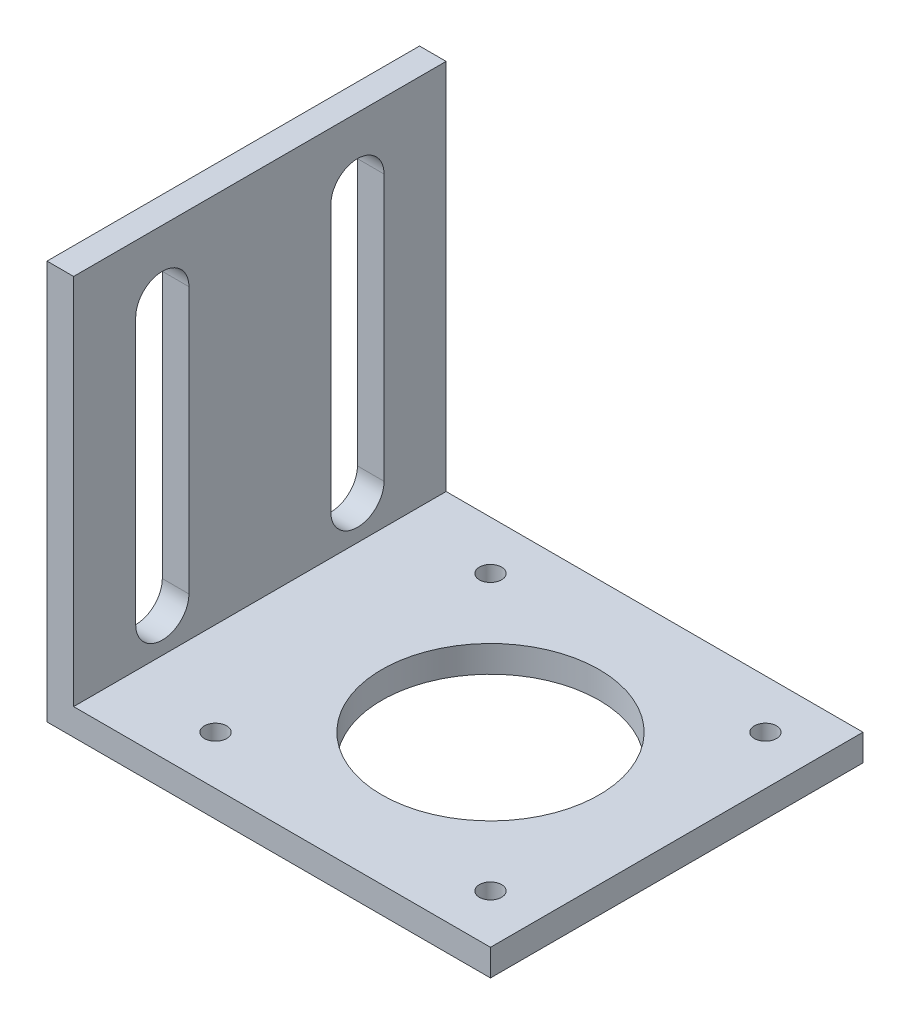
ISO-10303-21;
HEADER;
FILE_DESCRIPTION(('STEP AP214'),'2;1');
FILE_NAME('part.step','',(''),(''),'','','');
FILE_SCHEMA(('AUTOMOTIVE_DESIGN { 1 0 10303 214 1 1 1 1 }'));
ENDSEC;
DATA;
#1=APPLICATION_CONTEXT('core data for automotive mechanical design processes');
#2=APPLICATION_PROTOCOL_DEFINITION('international standard','automotive_design',2000,#1);
#3=PRODUCT_CONTEXT('',#1,'mechanical');
#4=PRODUCT('Part','Part','',(#3));
#5=PRODUCT_RELATED_PRODUCT_CATEGORY('part','',(#4));
#6=PRODUCT_DEFINITION_FORMATION('','',#4);
#7=PRODUCT_DEFINITION_CONTEXT('part definition',#1,'design');
#8=PRODUCT_DEFINITION('design','',#6,#7);
#9=PRODUCT_DEFINITION_SHAPE('','',#8);
#10=(LENGTH_UNIT() NAMED_UNIT(*) SI_UNIT(.MILLI.,.METRE.));
#11=(NAMED_UNIT(*) PLANE_ANGLE_UNIT() SI_UNIT($,.RADIAN.));
#12=(NAMED_UNIT(*) SI_UNIT($,.STERADIAN.) SOLID_ANGLE_UNIT());
#13=UNCERTAINTY_MEASURE_WITH_UNIT(LENGTH_MEASURE(1.E-05),#10,'distance_accuracy_value','');
#14=(GEOMETRIC_REPRESENTATION_CONTEXT(3) GLOBAL_UNCERTAINTY_ASSIGNED_CONTEXT((#13)) GLOBAL_UNIT_ASSIGNED_CONTEXT((#10,
#11,#12)) REPRESENTATION_CONTEXT('',''));
#15=CARTESIAN_POINT('',(0.,0.,0.));
#16=DIRECTION('',(0.,0.,1.));
#17=DIRECTION('',(1.,0.,0.));
#18=AXIS2_PLACEMENT_3D('',#15,#16,#17);
#19=CARTESIAN_POINT('',(25.,3.,-21.));
#20=DIRECTION('',(-1.,0.,0.));
#21=DIRECTION('',(0.,0.,1.));
#22=AXIS2_PLACEMENT_3D('',#19,#20,#21);
#23=PLANE('',#22);
#24=DIRECTION('',(0.,0.,-1.));
#25=VECTOR('',#24,1.);
#26=CARTESIAN_POINT('',(25.,0.,-21.));
#27=LINE('',#26,#25);
#28=CARTESIAN_POINT('',(25.,0.,21.));
#29=VERTEX_POINT('',#28);
#30=CARTESIAN_POINT('',(25.,0.,-21.));
#31=VERTEX_POINT('',#30);
#32=EDGE_CURVE('E246',#29,#31,#27,.T.);
#33=ORIENTED_EDGE('',*,*,#32,.T.);
#34=DIRECTION('',(0.,-1.,0.));
#35=VECTOR('',#34,1.);
#36=CARTESIAN_POINT('',(25.,3.,-21.));
#37=LINE('',#36,#35);
#38=CARTESIAN_POINT('',(25.,3.,-21.));
#39=VERTEX_POINT('',#38);
#40=EDGE_CURVE('E281',#39,#31,#37,.T.);
#41=ORIENTED_EDGE('',*,*,#40,.F.);
#42=DIRECTION('',(0.,0.,-1.));
#43=VECTOR('',#42,1.);
#44=CARTESIAN_POINT('',(25.,3.,-21.));
#45=LINE('',#44,#43);
#46=CARTESIAN_POINT('',(25.,3.,21.));
#47=VERTEX_POINT('',#46);
#48=EDGE_CURVE('E247',#47,#39,#45,.T.);
#49=ORIENTED_EDGE('',*,*,#48,.F.);
#50=DIRECTION('',(0.,-1.,0.));
#51=VECTOR('',#50,1.);
#52=CARTESIAN_POINT('',(25.,3.,21.));
#53=LINE('',#52,#51);
#54=EDGE_CURVE('E258',#47,#29,#53,.T.);
#55=ORIENTED_EDGE('',*,*,#54,.T.);
#56=EDGE_LOOP('',(#33,#41,#49,#55));
#57=FACE_BOUND('',#56,.T.);
#58=ADVANCED_FACE('F51',(#57),#23,.F.);
#59=CARTESIAN_POINT('',(-25.,3.,-21.));
#60=DIRECTION('',(0.,0.,1.));
#61=DIRECTION('',(1.,0.,0.));
#62=AXIS2_PLACEMENT_3D('',#59,#60,#61);
#63=PLANE('',#62);
#64=DIRECTION('',(-1.,0.,0.));
#65=VECTOR('',#64,1.);
#66=CARTESIAN_POINT('',(-25.,0.,-21.));
#67=LINE('',#66,#65);
#68=CARTESIAN_POINT('',(-25.,0.,-21.));
#69=VERTEX_POINT('',#68);
#70=EDGE_CURVE('E262',#31,#69,#67,.T.);
#71=ORIENTED_EDGE('',*,*,#70,.T.);
#72=DIRECTION('',(0.,-1.,0.));
#73=VECTOR('',#72,1.);
#74=CARTESIAN_POINT('',(-25.,3.,-21.));
#75=LINE('',#74,#73);
#76=CARTESIAN_POINT('',(-25.,45.,-21.));
#77=VERTEX_POINT('',#76);
#78=EDGE_CURVE('E277',#77,#69,#75,.T.);
#79=ORIENTED_EDGE('',*,*,#78,.F.);
#80=DIRECTION('',(-1.,0.,0.));
#81=VECTOR('',#80,1.);
#82=CARTESIAN_POINT('',(-25.,45.,-21.));
#83=LINE('',#82,#81);
#84=CARTESIAN_POINT('',(-22.,45.,-21.));
#85=VERTEX_POINT('',#84);
#86=EDGE_CURVE('E231',#85,#77,#83,.T.);
#87=ORIENTED_EDGE('',*,*,#86,.F.);
#88=DIRECTION('',(0.,-1.,0.));
#89=VECTOR('',#88,1.);
#90=CARTESIAN_POINT('',(-22.,45.,-21.));
#91=LINE('',#90,#89);
#92=CARTESIAN_POINT('',(-22.,3.,-21.));
#93=VERTEX_POINT('',#92);
#94=EDGE_CURVE('E235',#85,#93,#91,.T.);
#95=ORIENTED_EDGE('',*,*,#94,.T.);
#96=DIRECTION('',(-1.,0.,0.));
#97=VECTOR('',#96,1.);
#98=CARTESIAN_POINT('',(-25.,3.,-21.));
#99=LINE('',#98,#97);
#100=EDGE_CURVE('E251',#39,#93,#99,.T.);
#101=ORIENTED_EDGE('',*,*,#100,.F.);
#102=ORIENTED_EDGE('',*,*,#40,.T.);
#103=EDGE_LOOP('',(#71,#79,#87,#95,#101,#102));
#104=FACE_BOUND('',#103,.T.);
#105=ADVANCED_FACE('F345',(#104),#63,.F.);
#106=CARTESIAN_POINT('',(-25.,3.,-21.));
#107=DIRECTION('',(1.,0.,0.));
#108=DIRECTION('',(0.,0.,-1.));
#109=AXIS2_PLACEMENT_3D('',#106,#107,#108);
#110=PLANE('',#109);
#111=DIRECTION('',(0.,1.,0.));
#112=VECTOR('',#111,1.);
#113=CARTESIAN_POINT('',(-25.,0.,-8.));
#114=LINE('',#113,#112);
#115=CARTESIAN_POINT('',(-25.,7.50000000000001,-8.));
#116=VERTEX_POINT('',#115);
#117=CARTESIAN_POINT('',(-25.,37.5,-8.00000000000001));
#118=VERTEX_POINT('',#117);
#119=EDGE_CURVE('E172',#116,#118,#114,.T.);
#120=ORIENTED_EDGE('',*,*,#119,.F.);
#121=CARTESIAN_POINT('',(-25.,7.50000000000001,-11.));
#122=DIRECTION('',(-1.,0.,0.));
#123=DIRECTION('',(0.,0.,1.));
#124=AXIS2_PLACEMENT_3D('',#121,#122,#123);
#125=CIRCLE('',#124,3.);
#126=CARTESIAN_POINT('',(-25.,7.50000000000001,-14.));
#127=VERTEX_POINT('',#126);
#128=EDGE_CURVE('E68',#127,#116,#125,.T.);
#129=ORIENTED_EDGE('',*,*,#128,.F.);
#130=DIRECTION('',(0.,1.,0.));
#131=VECTOR('',#130,1.);
#132=CARTESIAN_POINT('',(-25.,0.,-14.));
#133=LINE('',#132,#131);
#134=CARTESIAN_POINT('',(-25.,37.5,-14.));
#135=VERTEX_POINT('',#134);
#136=EDGE_CURVE('E180',#127,#135,#133,.T.);
#137=ORIENTED_EDGE('',*,*,#136,.T.);
#138=CARTESIAN_POINT('',(-25.,37.5,-11.));
#139=DIRECTION('',(-1.,0.,0.));
#140=DIRECTION('',(0.,0.,1.));
#141=AXIS2_PLACEMENT_3D('',#138,#139,#140);
#142=CIRCLE('',#141,3.);
#143=EDGE_CURVE('E161',#118,#135,#142,.T.);
#144=ORIENTED_EDGE('',*,*,#143,.F.);
#145=EDGE_LOOP('',(#120,#129,#137,#144));
#146=FACE_BOUND('',#145,.T.);
#147=CARTESIAN_POINT('',(-25.,37.5,11.));
#148=DIRECTION('',(-1.,0.,0.));
#149=DIRECTION('',(0.,0.,1.));
#150=AXIS2_PLACEMENT_3D('',#147,#148,#149);
#151=CIRCLE('',#150,3.);
#152=CARTESIAN_POINT('',(-25.,37.5,14.));
#153=VERTEX_POINT('',#152);
#154=CARTESIAN_POINT('',(-25.,37.5,7.99999999999999));
#155=VERTEX_POINT('',#154);
#156=EDGE_CURVE('E197',#153,#155,#151,.T.);
#157=ORIENTED_EDGE('',*,*,#156,.F.);
#158=DIRECTION('',(0.,1.,0.));
#159=VECTOR('',#158,1.);
#160=CARTESIAN_POINT('',(-25.,0.,14.));
#161=LINE('',#160,#159);
#162=CARTESIAN_POINT('',(-25.,7.50000000000003,14.));
#163=VERTEX_POINT('',#162);
#164=EDGE_CURVE('E76',#163,#153,#161,.T.);
#165=ORIENTED_EDGE('',*,*,#164,.F.);
#166=CARTESIAN_POINT('',(-25.,7.50000000000003,11.));
#167=DIRECTION('',(-1.,0.,0.));
#168=DIRECTION('',(0.,0.,1.));
#169=AXIS2_PLACEMENT_3D('',#166,#167,#168);
#170=CIRCLE('',#169,3.);
#171=CARTESIAN_POINT('',(-25.,7.50000000000002,8.));
#172=VERTEX_POINT('',#171);
#173=EDGE_CURVE('E205',#172,#163,#170,.T.);
#174=ORIENTED_EDGE('',*,*,#173,.F.);
#175=DIRECTION('',(0.,1.,0.));
#176=VECTOR('',#175,1.);
#177=CARTESIAN_POINT('',(-25.,0.,8.));
#178=LINE('',#177,#176);
#179=EDGE_CURVE('E201',#172,#155,#178,.T.);
#180=ORIENTED_EDGE('',*,*,#179,.T.);
#181=EDGE_LOOP('',(#157,#165,#174,#180));
#182=FACE_BOUND('',#181,.T.);
#183=DIRECTION('',(0.,0.,1.));
#184=VECTOR('',#183,1.);
#185=CARTESIAN_POINT('',(-25.,0.,-21.));
#186=LINE('',#185,#184);
#187=CARTESIAN_POINT('',(-25.,0.,21.));
#188=VERTEX_POINT('',#187);
#189=EDGE_CURVE('E265',#69,#188,#186,.T.);
#190=ORIENTED_EDGE('',*,*,#189,.T.);
#191=DIRECTION('',(0.,-1.,0.));
#192=VECTOR('',#191,1.);
#193=CARTESIAN_POINT('',(-25.,3.,21.));
#194=LINE('',#193,#192);
#195=CARTESIAN_POINT('',(-25.,45.,21.));
#196=VERTEX_POINT('',#195);
#197=EDGE_CURVE('E273',#196,#188,#194,.T.);
#198=ORIENTED_EDGE('',*,*,#197,.F.);
#199=DIRECTION('',(0.,0.,1.));
#200=VECTOR('',#199,1.);
#201=CARTESIAN_POINT('',(-25.,45.,-21.));
#202=LINE('',#201,#200);
#203=EDGE_CURVE('E221',#77,#196,#202,.T.);
#204=ORIENTED_EDGE('',*,*,#203,.F.);
#205=ORIENTED_EDGE('',*,*,#78,.T.);
#206=EDGE_LOOP('',(#190,#198,#204,#205));
#207=FACE_BOUND('',#206,.T.);
#208=ADVANCED_FACE('F177',(#146,#182,#207),#110,.F.);
#209=CARTESIAN_POINT('',(-25.,3.,21.));
#210=DIRECTION('',(0.,0.,-1.));
#211=DIRECTION('',(-1.,0.,0.));
#212=AXIS2_PLACEMENT_3D('',#209,#210,#211);
#213=PLANE('',#212);
#214=DIRECTION('',(1.,0.,0.));
#215=VECTOR('',#214,1.);
#216=CARTESIAN_POINT('',(-25.,0.,21.));
#217=LINE('',#216,#215);
#218=EDGE_CURVE('E252',#188,#29,#217,.T.);
#219=ORIENTED_EDGE('',*,*,#218,.T.);
#220=ORIENTED_EDGE('',*,*,#54,.F.);
#221=DIRECTION('',(1.,0.,0.));
#222=VECTOR('',#221,1.);
#223=CARTESIAN_POINT('',(-25.,3.,21.));
#224=LINE('',#223,#222);
#225=CARTESIAN_POINT('',(-22.,3.,21.));
#226=VERTEX_POINT('',#225);
#227=EDGE_CURVE('E255',#226,#47,#224,.T.);
#228=ORIENTED_EDGE('',*,*,#227,.F.);
#229=DIRECTION('',(0.,-1.,0.));
#230=VECTOR('',#229,1.);
#231=CARTESIAN_POINT('',(-22.,45.,21.));
#232=LINE('',#231,#230);
#233=CARTESIAN_POINT('',(-22.,45.,21.));
#234=VERTEX_POINT('',#233);
#235=EDGE_CURVE('E242',#234,#226,#232,.T.);
#236=ORIENTED_EDGE('',*,*,#235,.F.);
#237=DIRECTION('',(1.,0.,0.));
#238=VECTOR('',#237,1.);
#239=CARTESIAN_POINT('',(-25.,45.,21.));
#240=LINE('',#239,#238);
#241=EDGE_CURVE('E225',#196,#234,#240,.T.);
#242=ORIENTED_EDGE('',*,*,#241,.F.);
#243=ORIENTED_EDGE('',*,*,#197,.T.);
#244=EDGE_LOOP('',(#219,#220,#228,#236,#242,#243));
#245=FACE_BOUND('',#244,.T.);
#246=ADVANCED_FACE('F365',(#245),#213,.F.);
#247=CARTESIAN_POINT('',(0.,3.,0.));
#248=DIRECTION('',(0.,1.,0.));
#249=DIRECTION('',(0.,0.,1.));
#250=AXIS2_PLACEMENT_3D('',#247,#248,#249);
#251=PLANE('',#250);
#252=CARTESIAN_POINT('',(-11.5,3.,-15.4999999999748));
#253=DIRECTION('',(0.,1.,0.));
#254=DIRECTION('',(0.,0.,1.));
#255=AXIS2_PLACEMENT_3D('',#252,#253,#254);
#256=CIRCLE('',#255,1.25000000000721);
#257=CARTESIAN_POINT('',(-11.5,3.,-14.2499999999675));
#258=VERTEX_POINT('',#257);
#259=EDGE_CURVE('E479',#258,#258,#256,.T.);
#260=ORIENTED_EDGE('',*,*,#259,.F.);
#261=EDGE_LOOP('',(#260));
#262=FACE_BOUND('',#261,.T.);
#263=CARTESIAN_POINT('',(19.5,3.,-15.5000000000002));
#264=DIRECTION('',(0.,1.,0.));
#265=DIRECTION('',(0.,0.,1.));
#266=AXIS2_PLACEMENT_3D('',#263,#264,#265);
#267=CIRCLE('',#266,1.25);
#268=CARTESIAN_POINT('',(19.5,3.,-14.2500000000002));
#269=VERTEX_POINT('',#268);
#270=EDGE_CURVE('E472',#269,#269,#267,.T.);
#271=ORIENTED_EDGE('',*,*,#270,.F.);
#272=EDGE_LOOP('',(#271));
#273=FACE_BOUND('',#272,.T.);
#274=CARTESIAN_POINT('',(19.5,3.,15.4999999999743));
#275=DIRECTION('',(0.,1.,0.));
#276=DIRECTION('',(0.,0.,1.));
#277=AXIS2_PLACEMENT_3D('',#274,#275,#276);
#278=CIRCLE('',#277,1.24999999999152);
#279=CARTESIAN_POINT('',(19.5,3.,16.7499999999658));
#280=VERTEX_POINT('',#279);
#281=EDGE_CURVE('E460',#280,#280,#278,.T.);
#282=ORIENTED_EDGE('',*,*,#281,.F.);
#283=EDGE_LOOP('',(#282));
#284=FACE_BOUND('',#283,.T.);
#285=CARTESIAN_POINT('',(-11.4999999999745,3.,15.4999999999998));
#286=DIRECTION('',(0.,1.,0.));
#287=DIRECTION('',(0.,0.,1.));
#288=AXIS2_PLACEMENT_3D('',#285,#286,#287);
#289=CIRCLE('',#288,1.24999999997535);
#290=CARTESIAN_POINT('',(-11.4999999999745,3.,16.7499999999751));
#291=VERTEX_POINT('',#290);
#292=EDGE_CURVE('E471',#291,#291,#289,.T.);
#293=ORIENTED_EDGE('',*,*,#292,.F.);
#294=EDGE_LOOP('',(#293));
#295=FACE_BOUND('',#294,.T.);
#296=CARTESIAN_POINT('',(4.00000000000003,3.,-2.22044604925031E-13));
#297=DIRECTION('',(0.,1.,0.));
#298=DIRECTION('',(0.,0.,1.));
#299=AXIS2_PLACEMENT_3D('',#296,#297,#298);
#300=CIRCLE('',#299,12.25);
#301=CARTESIAN_POINT('',(4.00000000000003,3.,12.2499999999998));
#302=VERTEX_POINT('',#301);
#303=EDGE_CURVE('E313',#302,#302,#300,.T.);
#304=ORIENTED_EDGE('',*,*,#303,.F.);
#305=EDGE_LOOP('',(#304));
#306=FACE_BOUND('',#305,.T.);
#307=DIRECTION('',(0.,0.,-1.));
#308=VECTOR('',#307,1.);
#309=CARTESIAN_POINT('',(-22.,3.,-21.));
#310=LINE('',#309,#308);
#311=EDGE_CURVE('E190',#226,#93,#310,.T.);
#312=ORIENTED_EDGE('',*,*,#311,.F.);
#313=ORIENTED_EDGE('',*,*,#227,.T.);
#314=ORIENTED_EDGE('',*,*,#48,.T.);
#315=ORIENTED_EDGE('',*,*,#100,.T.);
#316=EDGE_LOOP('',(#312,#313,#314,#315));
#317=FACE_BOUND('',#316,.T.);
#318=ADVANCED_FACE('F361',(#262,#273,#284,#295,#306,#317),#251,.T.);
#319=CARTESIAN_POINT('',(0.,0.,0.));
#320=DIRECTION('',(0.,1.,0.));
#321=DIRECTION('',(0.,0.,1.));
#322=AXIS2_PLACEMENT_3D('',#319,#320,#321);
#323=PLANE('',#322);
#324=CARTESIAN_POINT('',(-11.5,0.,-15.4999999999748));
#325=DIRECTION('',(0.,1.,0.));
#326=DIRECTION('',(0.,0.,1.));
#327=AXIS2_PLACEMENT_3D('',#324,#325,#326);
#328=CIRCLE('',#327,1.25000000000721);
#329=CARTESIAN_POINT('',(-11.5,0.,-14.2499999999675));
#330=VERTEX_POINT('',#329);
#331=EDGE_CURVE('E54',#330,#330,#328,.T.);
#332=ORIENTED_EDGE('',*,*,#331,.T.);
#333=EDGE_LOOP('',(#332));
#334=FACE_BOUND('',#333,.T.);
#335=CARTESIAN_POINT('',(19.5,0.,-15.5000000000002));
#336=DIRECTION('',(0.,1.,0.));
#337=DIRECTION('',(0.,0.,1.));
#338=AXIS2_PLACEMENT_3D('',#335,#336,#337);
#339=CIRCLE('',#338,1.25);
#340=CARTESIAN_POINT('',(19.5,0.,-14.2500000000002));
#341=VERTEX_POINT('',#340);
#342=EDGE_CURVE('E320',#341,#341,#339,.T.);
#343=ORIENTED_EDGE('',*,*,#342,.T.);
#344=EDGE_LOOP('',(#343));
#345=FACE_BOUND('',#344,.T.);
#346=CARTESIAN_POINT('',(19.5,0.,15.4999999999743));
#347=DIRECTION('',(0.,1.,0.));
#348=DIRECTION('',(0.,0.,1.));
#349=AXIS2_PLACEMENT_3D('',#346,#347,#348);
#350=CIRCLE('',#349,1.24999999999152);
#351=CARTESIAN_POINT('',(19.5,0.,16.7499999999658));
#352=VERTEX_POINT('',#351);
#353=EDGE_CURVE('E317',#352,#352,#350,.T.);
#354=ORIENTED_EDGE('',*,*,#353,.T.);
#355=EDGE_LOOP('',(#354));
#356=FACE_BOUND('',#355,.T.);
#357=CARTESIAN_POINT('',(-11.4999999999745,0.,15.4999999999998));
#358=DIRECTION('',(0.,1.,0.));
#359=DIRECTION('',(0.,0.,1.));
#360=AXIS2_PLACEMENT_3D('',#357,#358,#359);
#361=CIRCLE('',#360,1.24999999997535);
#362=CARTESIAN_POINT('',(-11.4999999999745,0.,16.7499999999751));
#363=VERTEX_POINT('',#362);
#364=EDGE_CURVE('E312',#363,#363,#361,.T.);
#365=ORIENTED_EDGE('',*,*,#364,.T.);
#366=EDGE_LOOP('',(#365));
#367=FACE_BOUND('',#366,.T.);
#368=CARTESIAN_POINT('',(4.00000000000003,0.,-2.22044604925031E-13));
#369=DIRECTION('',(0.,1.,0.));
#370=DIRECTION('',(0.,0.,1.));
#371=AXIS2_PLACEMENT_3D('',#368,#369,#370);
#372=CIRCLE('',#371,12.25);
#373=CARTESIAN_POINT('',(4.00000000000003,0.,12.2499999999998));
#374=VERTEX_POINT('',#373);
#375=EDGE_CURVE('E308',#374,#374,#372,.T.);
#376=ORIENTED_EDGE('',*,*,#375,.T.);
#377=EDGE_LOOP('',(#376));
#378=FACE_BOUND('',#377,.T.);
#379=ORIENTED_EDGE('',*,*,#32,.F.);
#380=ORIENTED_EDGE('',*,*,#218,.F.);
#381=ORIENTED_EDGE('',*,*,#189,.F.);
#382=ORIENTED_EDGE('',*,*,#70,.F.);
#383=EDGE_LOOP('',(#379,#380,#381,#382));
#384=FACE_BOUND('',#383,.T.);
#385=ADVANCED_FACE('F329',(#334,#345,#356,#367,#378,#384),#323,.F.);
#386=CARTESIAN_POINT('',(-22.,45.,-21.));
#387=DIRECTION('',(-1.,0.,0.));
#388=DIRECTION('',(0.,0.,1.));
#389=AXIS2_PLACEMENT_3D('',#386,#387,#388);
#390=PLANE('',#389);
#391=DIRECTION('',(0.,1.,0.));
#392=VECTOR('',#391,1.);
#393=CARTESIAN_POINT('',(-22.,45.,-14.));
#394=LINE('',#393,#392);
#395=CARTESIAN_POINT('',(-22.,7.50000000000001,-14.));
#396=VERTEX_POINT('',#395);
#397=CARTESIAN_POINT('',(-22.,37.5,-14.));
#398=VERTEX_POINT('',#397);
#399=EDGE_CURVE('E60',#396,#398,#394,.T.);
#400=ORIENTED_EDGE('',*,*,#399,.F.);
#401=CARTESIAN_POINT('',(-22.,7.50000000000001,-11.));
#402=DIRECTION('',(-1.,0.,0.));
#403=DIRECTION('',(0.,0.,1.));
#404=AXIS2_PLACEMENT_3D('',#401,#402,#403);
#405=CIRCLE('',#404,3.);
#406=CARTESIAN_POINT('',(-22.,7.50000000000001,-8.));
#407=VERTEX_POINT('',#406);
#408=EDGE_CURVE('E13',#396,#407,#405,.T.);
#409=ORIENTED_EDGE('',*,*,#408,.T.);
#410=DIRECTION('',(0.,1.,0.));
#411=VECTOR('',#410,1.);
#412=CARTESIAN_POINT('',(-22.,45.,-8.00000000000001));
#413=LINE('',#412,#411);
#414=CARTESIAN_POINT('',(-22.,37.5,-8.00000000000001));
#415=VERTEX_POINT('',#414);
#416=EDGE_CURVE('E301',#407,#415,#413,.T.);
#417=ORIENTED_EDGE('',*,*,#416,.T.);
#418=CARTESIAN_POINT('',(-22.,37.5,-11.));
#419=DIRECTION('',(-1.,0.,0.));
#420=DIRECTION('',(0.,0.,1.));
#421=AXIS2_PLACEMENT_3D('',#418,#419,#420);
#422=CIRCLE('',#421,3.);
#423=EDGE_CURVE('E164',#415,#398,#422,.T.);
#424=ORIENTED_EDGE('',*,*,#423,.T.);
#425=EDGE_LOOP('',(#400,#409,#417,#424));
#426=FACE_BOUND('',#425,.T.);
#427=CARTESIAN_POINT('',(-22.,7.50000000000003,11.));
#428=DIRECTION('',(-1.,0.,0.));
#429=DIRECTION('',(0.,0.,1.));
#430=AXIS2_PLACEMENT_3D('',#427,#428,#429);
#431=CIRCLE('',#430,3.);
#432=CARTESIAN_POINT('',(-22.,7.50000000000002,8.));
#433=VERTEX_POINT('',#432);
#434=CARTESIAN_POINT('',(-22.,7.50000000000003,14.));
#435=VERTEX_POINT('',#434);
#436=EDGE_CURVE('E293',#433,#435,#431,.T.);
#437=ORIENTED_EDGE('',*,*,#436,.T.);
#438=DIRECTION('',(0.,1.,0.));
#439=VECTOR('',#438,1.);
#440=CARTESIAN_POINT('',(-22.,45.,14.));
#441=LINE('',#440,#439);
#442=CARTESIAN_POINT('',(-22.,37.5,14.));
#443=VERTEX_POINT('',#442);
#444=EDGE_CURVE('E297',#435,#443,#441,.T.);
#445=ORIENTED_EDGE('',*,*,#444,.T.);
#446=CARTESIAN_POINT('',(-22.,37.5,11.));
#447=DIRECTION('',(-1.,0.,0.));
#448=DIRECTION('',(0.,0.,1.));
#449=AXIS2_PLACEMENT_3D('',#446,#447,#448);
#450=CIRCLE('',#449,3.);
#451=CARTESIAN_POINT('',(-22.,37.5,8.));
#452=VERTEX_POINT('',#451);
#453=EDGE_CURVE('E285',#443,#452,#450,.T.);
#454=ORIENTED_EDGE('',*,*,#453,.T.);
#455=DIRECTION('',(0.,1.,0.));
#456=VECTOR('',#455,1.);
#457=CARTESIAN_POINT('',(-22.,45.,7.99999999999999));
#458=LINE('',#457,#456);
#459=EDGE_CURVE('E289',#433,#452,#458,.T.);
#460=ORIENTED_EDGE('',*,*,#459,.F.);
#461=EDGE_LOOP('',(#437,#445,#454,#460));
#462=FACE_BOUND('',#461,.T.);
#463=ORIENTED_EDGE('',*,*,#311,.T.);
#464=ORIENTED_EDGE('',*,*,#94,.F.);
#465=DIRECTION('',(0.,0.,-1.));
#466=VECTOR('',#465,1.);
#467=CARTESIAN_POINT('',(-22.,45.,-21.));
#468=LINE('',#467,#466);
#469=EDGE_CURVE('E228',#234,#85,#468,.T.);
#470=ORIENTED_EDGE('',*,*,#469,.F.);
#471=ORIENTED_EDGE('',*,*,#235,.T.);
#472=EDGE_LOOP('',(#463,#464,#470,#471));
#473=FACE_BOUND('',#472,.T.);
#474=ADVANCED_FACE('F373',(#426,#462,#473),#390,.F.);
#475=CARTESIAN_POINT('',(0.,45.,0.));
#476=DIRECTION('',(0.,1.,0.));
#477=DIRECTION('',(0.,0.,1.));
#478=AXIS2_PLACEMENT_3D('',#475,#476,#477);
#479=PLANE('',#478);
#480=ORIENTED_EDGE('',*,*,#203,.T.);
#481=ORIENTED_EDGE('',*,*,#241,.T.);
#482=ORIENTED_EDGE('',*,*,#469,.T.);
#483=ORIENTED_EDGE('',*,*,#86,.T.);
#484=EDGE_LOOP('',(#480,#481,#482,#483));
#485=FACE_BOUND('',#484,.T.);
#486=ADVANCED_FACE('F370',(#485),#479,.T.);
#487=CARTESIAN_POINT('',(-15.,0.,14.));
#488=DIRECTION('',(0.,0.,1.));
#489=DIRECTION('',(1.,0.,0.));
#490=AXIS2_PLACEMENT_3D('',#487,#488,#489);
#491=PLANE('',#490);
#492=DIRECTION('',(-1.,0.,0.));
#493=VECTOR('',#492,1.);
#494=CARTESIAN_POINT('',(-15.,7.50000000000003,14.));
#495=LINE('',#494,#493);
#496=EDGE_CURVE('E210',#435,#163,#495,.T.);
#497=ORIENTED_EDGE('',*,*,#496,.T.);
#498=ORIENTED_EDGE('',*,*,#164,.T.);
#499=DIRECTION('',(-1.,0.,0.));
#500=VECTOR('',#499,1.);
#501=CARTESIAN_POINT('',(-15.,37.5,14.));
#502=LINE('',#501,#500);
#503=EDGE_CURVE('E209',#443,#153,#502,.T.);
#504=ORIENTED_EDGE('',*,*,#503,.F.);
#505=ORIENTED_EDGE('',*,*,#444,.F.);
#506=EDGE_LOOP('',(#497,#498,#504,#505));
#507=FACE_BOUND('',#506,.T.);
#508=ADVANCED_FACE('F381',(#507),#491,.F.);
#509=CARTESIAN_POINT('',(-15.,7.50000000000003,11.));
#510=DIRECTION('',(-1.,0.,0.));
#511=DIRECTION('',(0.,0.,1.));
#512=AXIS2_PLACEMENT_3D('',#509,#510,#511);
#513=CYLINDRICAL_SURFACE('',#512,3.);
#514=DIRECTION('',(-1.,0.,0.));
#515=VECTOR('',#514,1.);
#516=CARTESIAN_POINT('',(-15.,7.50000000000002,8.));
#517=LINE('',#516,#515);
#518=EDGE_CURVE('E213',#433,#172,#517,.T.);
#519=ORIENTED_EDGE('',*,*,#518,.T.);
#520=ORIENTED_EDGE('',*,*,#173,.T.);
#521=ORIENTED_EDGE('',*,*,#496,.F.);
#522=ORIENTED_EDGE('',*,*,#436,.F.);
#523=EDGE_LOOP('',(#519,#520,#521,#522));
#524=FACE_BOUND('',#523,.T.);
#525=ADVANCED_FACE('F532',(#524),#513,.F.);
#526=CARTESIAN_POINT('',(-15.,0.,8.));
#527=DIRECTION('',(0.,0.,1.));
#528=DIRECTION('',(0.,-1.,0.));
#529=AXIS2_PLACEMENT_3D('',#526,#527,#528);
#530=PLANE('',#529);
#531=ORIENTED_EDGE('',*,*,#459,.T.);
#532=DIRECTION('',(-1.,0.,0.));
#533=VECTOR('',#532,1.);
#534=CARTESIAN_POINT('',(-15.,37.5,7.99999999999999));
#535=LINE('',#534,#533);
#536=EDGE_CURVE('E216',#452,#155,#535,.T.);
#537=ORIENTED_EDGE('',*,*,#536,.T.);
#538=ORIENTED_EDGE('',*,*,#179,.F.);
#539=ORIENTED_EDGE('',*,*,#518,.F.);
#540=EDGE_LOOP('',(#531,#537,#538,#539));
#541=FACE_BOUND('',#540,.T.);
#542=ADVANCED_FACE('F524',(#541),#530,.T.);
#543=CARTESIAN_POINT('',(-15.,37.5,11.));
#544=DIRECTION('',(-1.,0.,0.));
#545=DIRECTION('',(0.,0.,1.));
#546=AXIS2_PLACEMENT_3D('',#543,#544,#545);
#547=CYLINDRICAL_SURFACE('',#546,3.);
#548=ORIENTED_EDGE('',*,*,#503,.T.);
#549=ORIENTED_EDGE('',*,*,#156,.T.);
#550=ORIENTED_EDGE('',*,*,#536,.F.);
#551=ORIENTED_EDGE('',*,*,#453,.F.);
#552=EDGE_LOOP('',(#548,#549,#550,#551));
#553=FACE_BOUND('',#552,.T.);
#554=ADVANCED_FACE('F517',(#553),#547,.F.);
#555=CARTESIAN_POINT('',(-15.,7.50000000000001,-11.));
#556=DIRECTION('',(-1.,0.,0.));
#557=DIRECTION('',(0.,0.,1.));
#558=AXIS2_PLACEMENT_3D('',#555,#556,#557);
#559=CYLINDRICAL_SURFACE('',#558,3.);
#560=DIRECTION('',(-1.,0.,0.));
#561=VECTOR('',#560,1.);
#562=CARTESIAN_POINT('',(-15.,7.50000000000001,-14.));
#563=LINE('',#562,#561);
#564=EDGE_CURVE('E187',#396,#127,#563,.T.);
#565=ORIENTED_EDGE('',*,*,#564,.T.);
#566=ORIENTED_EDGE('',*,*,#128,.T.);
#567=DIRECTION('',(-1.,0.,0.));
#568=VECTOR('',#567,1.);
#569=CARTESIAN_POINT('',(-15.,7.50000000000001,-8.00000000000001));
#570=LINE('',#569,#568);
#571=EDGE_CURVE('E169',#407,#116,#570,.T.);
#572=ORIENTED_EDGE('',*,*,#571,.F.);
#573=ORIENTED_EDGE('',*,*,#408,.F.);
#574=EDGE_LOOP('',(#565,#566,#572,#573));
#575=FACE_BOUND('',#574,.T.);
#576=ADVANCED_FACE('F509',(#575),#559,.F.);
#577=CARTESIAN_POINT('',(-15.,0.,-14.));
#578=DIRECTION('',(0.,0.,1.));
#579=DIRECTION('',(1.,0.,0.));
#580=AXIS2_PLACEMENT_3D('',#577,#578,#579);
#581=PLANE('',#580);
#582=ORIENTED_EDGE('',*,*,#399,.T.);
#583=DIRECTION('',(-1.,0.,0.));
#584=VECTOR('',#583,1.);
#585=CARTESIAN_POINT('',(-15.,37.5,-14.));
#586=LINE('',#585,#584);
#587=EDGE_CURVE('E168',#398,#135,#586,.T.);
#588=ORIENTED_EDGE('',*,*,#587,.T.);
#589=ORIENTED_EDGE('',*,*,#136,.F.);
#590=ORIENTED_EDGE('',*,*,#564,.F.);
#591=EDGE_LOOP('',(#582,#588,#589,#590));
#592=FACE_BOUND('',#591,.T.);
#593=ADVANCED_FACE('F502',(#592),#581,.T.);
#594=CARTESIAN_POINT('',(-15.,37.5,-11.));
#595=DIRECTION('',(-1.,0.,0.));
#596=DIRECTION('',(0.,0.,1.));
#597=AXIS2_PLACEMENT_3D('',#594,#595,#596);
#598=CYLINDRICAL_SURFACE('',#597,3.);
#599=DIRECTION('',(-1.,0.,0.));
#600=VECTOR('',#599,1.);
#601=CARTESIAN_POINT('',(-15.,37.5,-8.00000000000001));
#602=LINE('',#601,#600);
#603=EDGE_CURVE('E156',#415,#118,#602,.T.);
#604=ORIENTED_EDGE('',*,*,#603,.T.);
#605=ORIENTED_EDGE('',*,*,#143,.T.);
#606=ORIENTED_EDGE('',*,*,#587,.F.);
#607=ORIENTED_EDGE('',*,*,#423,.F.);
#608=EDGE_LOOP('',(#604,#605,#606,#607));
#609=FACE_BOUND('',#608,.T.);
#610=ADVANCED_FACE('F158',(#609),#598,.F.);
#611=CARTESIAN_POINT('',(-15.,0.,-8.00000000000001));
#612=DIRECTION('',(0.,0.,1.));
#613=DIRECTION('',(1.,0.,0.));
#614=AXIS2_PLACEMENT_3D('',#611,#612,#613);
#615=PLANE('',#614);
#616=ORIENTED_EDGE('',*,*,#571,.T.);
#617=ORIENTED_EDGE('',*,*,#119,.T.);
#618=ORIENTED_EDGE('',*,*,#603,.F.);
#619=ORIENTED_EDGE('',*,*,#416,.F.);
#620=EDGE_LOOP('',(#616,#617,#618,#619));
#621=FACE_BOUND('',#620,.T.);
#622=ADVANCED_FACE('F173',(#621),#615,.F.);
#623=CARTESIAN_POINT('',(4.00000000000003,-7.,-2.22044604925031E-13));
#624=DIRECTION('',(0.,1.,0.));
#625=DIRECTION('',(0.,0.,1.));
#626=AXIS2_PLACEMENT_3D('',#623,#624,#625);
#627=CYLINDRICAL_SURFACE('',#626,12.25);
#628=ORIENTED_EDGE('',*,*,#303,.T.);
#629=EDGE_LOOP('',(#628));
#630=FACE_BOUND('',#629,.T.);
#631=ORIENTED_EDGE('',*,*,#375,.F.);
#632=EDGE_LOOP('',(#631));
#633=FACE_BOUND('',#632,.T.);
#634=ADVANCED_FACE('F418',(#630,#633),#627,.F.);
#635=CARTESIAN_POINT('',(-11.4999999999745,-7.,15.4999999999998));
#636=DIRECTION('',(0.,1.,0.));
#637=DIRECTION('',(0.,0.,1.));
#638=AXIS2_PLACEMENT_3D('',#635,#636,#637);
#639=CYLINDRICAL_SURFACE('',#638,1.24999999997535);
#640=ORIENTED_EDGE('',*,*,#292,.T.);
#641=EDGE_LOOP('',(#640));
#642=FACE_BOUND('',#641,.T.);
#643=ORIENTED_EDGE('',*,*,#364,.F.);
#644=EDGE_LOOP('',(#643));
#645=FACE_BOUND('',#644,.T.);
#646=ADVANCED_FACE('F423',(#642,#645),#639,.F.);
#647=CARTESIAN_POINT('',(19.5,-7.,15.4999999999743));
#648=DIRECTION('',(0.,1.,0.));
#649=DIRECTION('',(0.,0.,1.));
#650=AXIS2_PLACEMENT_3D('',#647,#648,#649);
#651=CYLINDRICAL_SURFACE('',#650,1.24999999999152);
#652=ORIENTED_EDGE('',*,*,#281,.T.);
#653=EDGE_LOOP('',(#652));
#654=FACE_BOUND('',#653,.T.);
#655=ORIENTED_EDGE('',*,*,#353,.F.);
#656=EDGE_LOOP('',(#655));
#657=FACE_BOUND('',#656,.T.);
#658=ADVANCED_FACE('F339',(#654,#657),#651,.F.);
#659=CARTESIAN_POINT('',(19.5,-7.,-15.5000000000002));
#660=DIRECTION('',(0.,1.,0.));
#661=DIRECTION('',(0.,0.,1.));
#662=AXIS2_PLACEMENT_3D('',#659,#660,#661);
#663=CYLINDRICAL_SURFACE('',#662,1.25);
#664=ORIENTED_EDGE('',*,*,#270,.T.);
#665=EDGE_LOOP('',(#664));
#666=FACE_BOUND('',#665,.T.);
#667=ORIENTED_EDGE('',*,*,#342,.F.);
#668=EDGE_LOOP('',(#667));
#669=FACE_BOUND('',#668,.T.);
#670=ADVANCED_FACE('F333',(#666,#669),#663,.F.);
#671=CARTESIAN_POINT('',(-11.5,-7.,-15.4999999999748));
#672=DIRECTION('',(0.,1.,0.));
#673=DIRECTION('',(0.,0.,1.));
#674=AXIS2_PLACEMENT_3D('',#671,#672,#673);
#675=CYLINDRICAL_SURFACE('',#674,1.25000000000721);
#676=ORIENTED_EDGE('',*,*,#259,.T.);
#677=EDGE_LOOP('',(#676));
#678=FACE_BOUND('',#677,.T.);
#679=ORIENTED_EDGE('',*,*,#331,.F.);
#680=EDGE_LOOP('',(#679));
#681=FACE_BOUND('',#680,.T.);
#682=ADVANCED_FACE('F331',(#678,#681),#675,.F.);
#683=CLOSED_SHELL('',(#58,#105,#208,#246,#318,#385,#474,#486,#508,#525,#542,#554,#576,#593,#610,
#622,#634,#646,#658,#670,#682));
#684=MANIFOLD_SOLID_BREP('B2',#683);
#685=ADVANCED_BREP_SHAPE_REPRESENTATION('',(#18,#684),#14);
#686=SHAPE_DEFINITION_REPRESENTATION(#9,#685);
ENDSEC;
END-ISO-10303-21;
